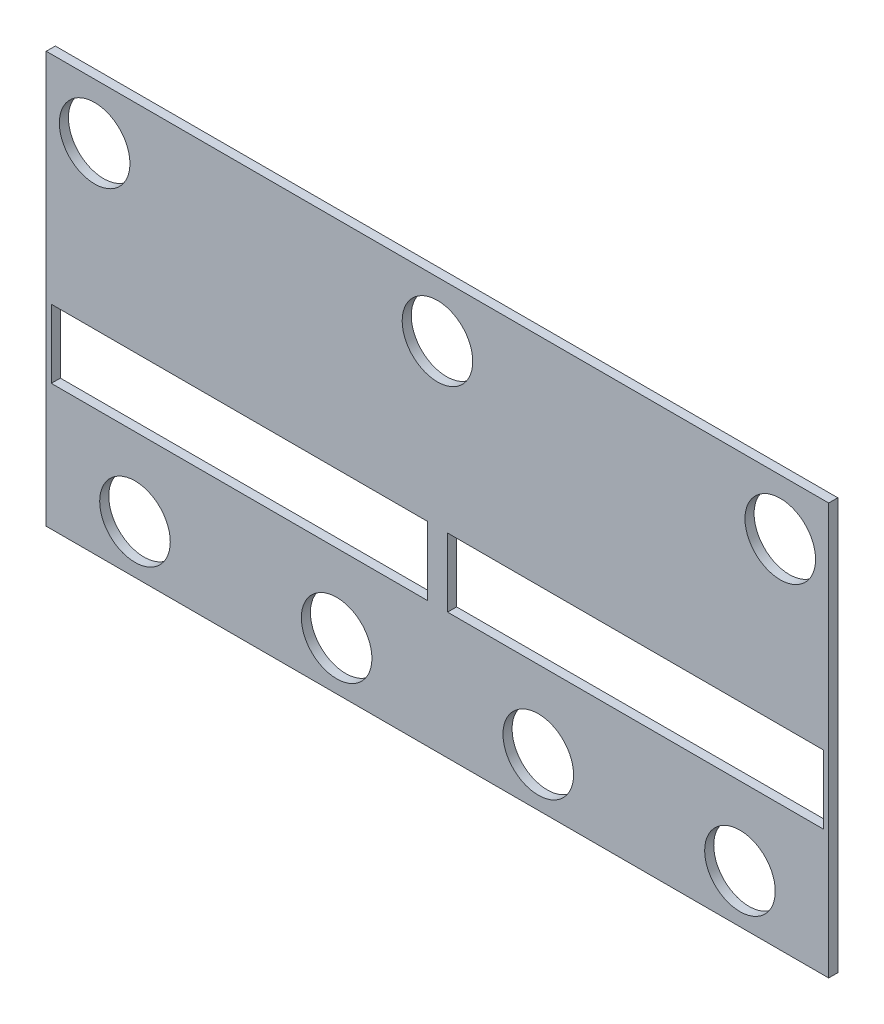
ISO-10303-21;
HEADER;
FILE_DESCRIPTION(('STEP AP214'),'2;1');
FILE_NAME('part.step','',(''),(''),'','','');
FILE_SCHEMA(('AUTOMOTIVE_DESIGN { 1 0 10303 214 1 1 1 1 }'));
ENDSEC;
DATA;
#1=APPLICATION_CONTEXT('core data for automotive mechanical design processes');
#2=APPLICATION_PROTOCOL_DEFINITION('international standard','automotive_design',2000,#1);
#3=PRODUCT_CONTEXT('',#1,'mechanical');
#4=PRODUCT('Part','Part','',(#3));
#5=PRODUCT_RELATED_PRODUCT_CATEGORY('part','',(#4));
#6=PRODUCT_DEFINITION_FORMATION('','',#4);
#7=PRODUCT_DEFINITION_CONTEXT('part definition',#1,'design');
#8=PRODUCT_DEFINITION('design','',#6,#7);
#9=PRODUCT_DEFINITION_SHAPE('','',#8);
#10=(LENGTH_UNIT() NAMED_UNIT(*) SI_UNIT(.MILLI.,.METRE.));
#11=(NAMED_UNIT(*) PLANE_ANGLE_UNIT() SI_UNIT($,.RADIAN.));
#12=(NAMED_UNIT(*) SI_UNIT($,.STERADIAN.) SOLID_ANGLE_UNIT());
#13=UNCERTAINTY_MEASURE_WITH_UNIT(LENGTH_MEASURE(1.E-05),#10,'distance_accuracy_value','');
#14=(GEOMETRIC_REPRESENTATION_CONTEXT(3) GLOBAL_UNCERTAINTY_ASSIGNED_CONTEXT((#13)) GLOBAL_UNIT_ASSIGNED_CONTEXT((#10,
#11,#12)) REPRESENTATION_CONTEXT('',''));
#15=CARTESIAN_POINT('',(0.,0.,0.));
#16=DIRECTION('',(0.,0.,1.));
#17=DIRECTION('',(1.,0.,0.));
#18=AXIS2_PLACEMENT_3D('',#15,#16,#17);
#19=CARTESIAN_POINT('',(-40.,25.,-3.));
#20=DIRECTION('',(0.,1.,0.));
#21=DIRECTION('',(0.,0.,1.));
#22=AXIS2_PLACEMENT_3D('',#19,#20,#21);
#23=PLANE('',#22);
#24=DIRECTION('',(0.,0.,1.));
#25=VECTOR('',#24,1.);
#26=CARTESIAN_POINT('',(-38.8,25.,-3.));
#27=LINE('',#26,#25);
#28=CARTESIAN_POINT('',(-38.8,25.,-3.));
#29=VERTEX_POINT('',#28);
#30=CARTESIAN_POINT('',(-38.8,25.,-2.1));
#31=VERTEX_POINT('',#30);
#32=EDGE_CURVE('E204',#29,#31,#27,.T.);
#33=ORIENTED_EDGE('',*,*,#32,.T.);
#34=DIRECTION('',(1.,0.,0.));
#35=VECTOR('',#34,1.);
#36=CARTESIAN_POINT('',(-38.8,25.,-2.1));
#37=LINE('',#36,#35);
#38=CARTESIAN_POINT('',(38.8,25.,-2.1));
#39=VERTEX_POINT('',#38);
#40=EDGE_CURVE('E58',#31,#39,#37,.T.);
#41=ORIENTED_EDGE('',*,*,#40,.T.);
#42=DIRECTION('',(0.,0.,1.));
#43=VECTOR('',#42,1.);
#44=CARTESIAN_POINT('',(38.8,25.,-3.));
#45=LINE('',#44,#43);
#46=CARTESIAN_POINT('',(38.8,25.,-3.));
#47=VERTEX_POINT('',#46);
#48=EDGE_CURVE('E145',#47,#39,#45,.T.);
#49=ORIENTED_EDGE('',*,*,#48,.F.);
#50=DIRECTION('',(-1.,0.,0.));
#51=VECTOR('',#50,1.);
#52=CARTESIAN_POINT('',(-40.,25.,-3.));
#53=LINE('',#52,#51);
#54=EDGE_CURVE('E13',#47,#29,#53,.T.);
#55=ORIENTED_EDGE('',*,*,#54,.T.);
#56=EDGE_LOOP('',(#33,#41,#49,#55));
#57=FACE_BOUND('',#56,.T.);
#58=ADVANCED_FACE('F43',(#57),#23,.T.);
#59=CARTESIAN_POINT('',(38.8,-15.8,1.));
#60=DIRECTION('',(-1.,0.,0.));
#61=DIRECTION('',(0.,0.,1.));
#62=AXIS2_PLACEMENT_3D('',#59,#60,#61);
#63=PLANE('',#62);
#64=DIRECTION('',(0.,-1.,0.));
#65=VECTOR('',#64,1.);
#66=CARTESIAN_POINT('',(38.8,25.,-2.1));
#67=LINE('',#66,#65);
#68=CARTESIAN_POINT('',(38.8,-15.8,-2.10000000000003));
#69=VERTEX_POINT('',#68);
#70=EDGE_CURVE('E134',#39,#69,#67,.T.);
#71=ORIENTED_EDGE('',*,*,#70,.T.);
#72=DIRECTION('',(0.,0.,-1.));
#73=VECTOR('',#72,1.);
#74=CARTESIAN_POINT('',(38.8,-15.8,1.));
#75=LINE('',#74,#73);
#76=CARTESIAN_POINT('',(38.8,-15.8,-3.));
#77=VERTEX_POINT('',#76);
#78=EDGE_CURVE('E51',#69,#77,#75,.T.);
#79=ORIENTED_EDGE('',*,*,#78,.T.);
#80=DIRECTION('',(0.,1.,0.));
#81=VECTOR('',#80,1.);
#82=CARTESIAN_POINT('',(38.8,16.,-3.));
#83=LINE('',#82,#81);
#84=EDGE_CURVE('E176',#77,#47,#83,.T.);
#85=ORIENTED_EDGE('',*,*,#84,.T.);
#86=ORIENTED_EDGE('',*,*,#48,.T.);
#87=EDGE_LOOP('',(#71,#79,#85,#86));
#88=FACE_BOUND('',#87,.T.);
#89=ADVANCED_FACE('F142',(#88),#63,.F.);
#90=CARTESIAN_POINT('',(-38.8,-15.8,1.));
#91=DIRECTION('',(0.,1.,0.));
#92=DIRECTION('',(-1.,0.,0.));
#93=AXIS2_PLACEMENT_3D('',#90,#91,#92);
#94=PLANE('',#93);
#95=DIRECTION('',(-1.,0.,0.));
#96=VECTOR('',#95,1.);
#97=CARTESIAN_POINT('',(-38.8,-15.8,-2.1));
#98=LINE('',#97,#96);
#99=CARTESIAN_POINT('',(-38.8,-15.8,-2.1));
#100=VERTEX_POINT('',#99);
#101=EDGE_CURVE('E130',#69,#100,#98,.T.);
#102=ORIENTED_EDGE('',*,*,#101,.T.);
#103=DIRECTION('',(0.,0.,-1.));
#104=VECTOR('',#103,1.);
#105=CARTESIAN_POINT('',(-38.8,-15.8,1.));
#106=LINE('',#105,#104);
#107=CARTESIAN_POINT('',(-38.8,-15.8,-3.));
#108=VERTEX_POINT('',#107);
#109=EDGE_CURVE('E151',#100,#108,#106,.T.);
#110=ORIENTED_EDGE('',*,*,#109,.T.);
#111=DIRECTION('',(1.,0.,0.));
#112=VECTOR('',#111,1.);
#113=CARTESIAN_POINT('',(38.8,-15.8,-3.));
#114=LINE('',#113,#112);
#115=EDGE_CURVE('E149',#108,#77,#114,.T.);
#116=ORIENTED_EDGE('',*,*,#115,.T.);
#117=ORIENTED_EDGE('',*,*,#78,.F.);
#118=EDGE_LOOP('',(#102,#110,#116,#117));
#119=FACE_BOUND('',#118,.T.);
#120=ADVANCED_FACE('F147',(#119),#94,.F.);
#121=CARTESIAN_POINT('',(-38.8,16.,1.));
#122=DIRECTION('',(1.,0.,0.));
#123=DIRECTION('',(0.,1.,0.));
#124=AXIS2_PLACEMENT_3D('',#121,#122,#123);
#125=PLANE('',#124);
#126=DIRECTION('',(0.,1.,0.));
#127=VECTOR('',#126,1.);
#128=CARTESIAN_POINT('',(-38.8,25.,-2.1));
#129=LINE('',#128,#127);
#130=EDGE_CURVE('E135',#100,#31,#129,.T.);
#131=ORIENTED_EDGE('',*,*,#130,.T.);
#132=ORIENTED_EDGE('',*,*,#32,.F.);
#133=DIRECTION('',(0.,-1.,0.));
#134=VECTOR('',#133,1.);
#135=CARTESIAN_POINT('',(-38.8,16.,-3.));
#136=LINE('',#135,#134);
#137=EDGE_CURVE('E179',#29,#108,#136,.T.);
#138=ORIENTED_EDGE('',*,*,#137,.T.);
#139=ORIENTED_EDGE('',*,*,#109,.F.);
#140=EDGE_LOOP('',(#131,#132,#138,#139));
#141=FACE_BOUND('',#140,.T.);
#142=ADVANCED_FACE('F264',(#141),#125,.F.);
#143=CARTESIAN_POINT('',(38.3,3.525,-1.55));
#144=DIRECTION('',(1.,0.,0.));
#145=DIRECTION('',(0.,0.,-1.));
#146=AXIS2_PLACEMENT_3D('',#143,#144,#145);
#147=PLANE('',#146);
#148=DIRECTION('',(0.,-1.,0.));
#149=VECTOR('',#148,1.);
#150=CARTESIAN_POINT('',(38.3,3.525,-2.1));
#151=LINE('',#150,#149);
#152=CARTESIAN_POINT('',(38.3,3.525,-2.1));
#153=VERTEX_POINT('',#152);
#154=CARTESIAN_POINT('',(38.3,-3.275,-2.1));
#155=VERTEX_POINT('',#154);
#156=EDGE_CURVE('E66',#153,#155,#151,.T.);
#157=ORIENTED_EDGE('',*,*,#156,.F.);
#158=DIRECTION('',(0.,0.,-1.));
#159=VECTOR('',#158,1.);
#160=CARTESIAN_POINT('',(38.3,3.525,-1.55));
#161=LINE('',#160,#159);
#162=CARTESIAN_POINT('',(38.3,3.525,-3.));
#163=VERTEX_POINT('',#162);
#164=EDGE_CURVE('E182',#153,#163,#161,.T.);
#165=ORIENTED_EDGE('',*,*,#164,.T.);
#166=DIRECTION('',(0.,-1.,0.));
#167=VECTOR('',#166,1.);
#168=CARTESIAN_POINT('',(38.3,3.525,-3.));
#169=LINE('',#168,#167);
#170=CARTESIAN_POINT('',(38.3,-3.275,-3.));
#171=VERTEX_POINT('',#170);
#172=EDGE_CURVE('E192',#163,#171,#169,.T.);
#173=ORIENTED_EDGE('',*,*,#172,.T.);
#174=DIRECTION('',(0.,0.,-1.));
#175=VECTOR('',#174,1.);
#176=CARTESIAN_POINT('',(38.3,-3.275,-1.55));
#177=LINE('',#176,#175);
#178=EDGE_CURVE('E205',#155,#171,#177,.T.);
#179=ORIENTED_EDGE('',*,*,#178,.F.);
#180=EDGE_LOOP('',(#157,#165,#173,#179));
#181=FACE_BOUND('',#180,.T.);
#182=ADVANCED_FACE('F295',(#181),#147,.F.);
#183=CARTESIAN_POINT('',(38.3,3.525,-1.55));
#184=DIRECTION('',(0.,1.,0.));
#185=DIRECTION('',(-1.,0.,0.));
#186=AXIS2_PLACEMENT_3D('',#183,#184,#185);
#187=PLANE('',#186);
#188=DIRECTION('',(1.,0.,0.));
#189=VECTOR('',#188,1.);
#190=CARTESIAN_POINT('',(38.3,3.525,-2.1));
#191=LINE('',#190,#189);
#192=CARTESIAN_POINT('',(1.00000000000002,3.52500000000002,-2.1));
#193=VERTEX_POINT('',#192);
#194=EDGE_CURVE('E227',#193,#153,#191,.T.);
#195=ORIENTED_EDGE('',*,*,#194,.F.);
#196=DIRECTION('',(0.,0.,-1.));
#197=VECTOR('',#196,1.);
#198=CARTESIAN_POINT('',(1.00000000000002,3.52500000000002,-1.55));
#199=LINE('',#198,#197);
#200=CARTESIAN_POINT('',(1.00000000000002,3.52500000000002,-3.));
#201=VERTEX_POINT('',#200);
#202=EDGE_CURVE('E210',#193,#201,#199,.T.);
#203=ORIENTED_EDGE('',*,*,#202,.T.);
#204=DIRECTION('',(1.,0.,0.));
#205=VECTOR('',#204,1.);
#206=CARTESIAN_POINT('',(38.3,3.525,-3.));
#207=LINE('',#206,#205);
#208=EDGE_CURVE('E208',#201,#163,#207,.T.);
#209=ORIENTED_EDGE('',*,*,#208,.T.);
#210=ORIENTED_EDGE('',*,*,#164,.F.);
#211=EDGE_LOOP('',(#195,#203,#209,#210));
#212=FACE_BOUND('',#211,.T.);
#213=ADVANCED_FACE('F299',(#212),#187,.F.);
#214=CARTESIAN_POINT('',(1.00000000000002,3.52500000000002,-1.55));
#215=DIRECTION('',(-1.,0.,0.));
#216=DIRECTION('',(0.,-1.,0.));
#217=AXIS2_PLACEMENT_3D('',#214,#215,#216);
#218=PLANE('',#217);
#219=DIRECTION('',(0.,1.,0.));
#220=VECTOR('',#219,1.);
#221=CARTESIAN_POINT('',(1.00000000000002,3.52500000000002,-2.1));
#222=LINE('',#221,#220);
#223=CARTESIAN_POINT('',(1.00000000000002,-3.275,-2.1));
#224=VERTEX_POINT('',#223);
#225=EDGE_CURVE('E229',#224,#193,#222,.T.);
#226=ORIENTED_EDGE('',*,*,#225,.F.);
#227=DIRECTION('',(0.,0.,-1.));
#228=VECTOR('',#227,1.);
#229=CARTESIAN_POINT('',(1.00000000000002,-3.275,-1.55));
#230=LINE('',#229,#228);
#231=CARTESIAN_POINT('',(1.00000000000002,-3.275,-3.));
#232=VERTEX_POINT('',#231);
#233=EDGE_CURVE('E207',#224,#232,#230,.T.);
#234=ORIENTED_EDGE('',*,*,#233,.T.);
#235=DIRECTION('',(0.,1.,0.));
#236=VECTOR('',#235,1.);
#237=CARTESIAN_POINT('',(1.00000000000002,3.52500000000002,-3.));
#238=LINE('',#237,#236);
#239=EDGE_CURVE('E215',#232,#201,#238,.T.);
#240=ORIENTED_EDGE('',*,*,#239,.T.);
#241=ORIENTED_EDGE('',*,*,#202,.F.);
#242=EDGE_LOOP('',(#226,#234,#240,#241));
#243=FACE_BOUND('',#242,.T.);
#244=ADVANCED_FACE('F305',(#243),#218,.F.);
#245=CARTESIAN_POINT('',(38.3,-3.275,-1.55));
#246=DIRECTION('',(0.,-1.,0.));
#247=DIRECTION('',(0.,0.,-1.));
#248=AXIS2_PLACEMENT_3D('',#245,#246,#247);
#249=PLANE('',#248);
#250=DIRECTION('',(-1.,0.,0.));
#251=VECTOR('',#250,1.);
#252=CARTESIAN_POINT('',(38.3,-3.275,-2.1));
#253=LINE('',#252,#251);
#254=EDGE_CURVE('E231',#155,#224,#253,.T.);
#255=ORIENTED_EDGE('',*,*,#254,.F.);
#256=ORIENTED_EDGE('',*,*,#178,.T.);
#257=DIRECTION('',(-1.,0.,0.));
#258=VECTOR('',#257,1.);
#259=CARTESIAN_POINT('',(38.3,-3.275,-3.));
#260=LINE('',#259,#258);
#261=EDGE_CURVE('E218',#171,#232,#260,.T.);
#262=ORIENTED_EDGE('',*,*,#261,.T.);
#263=ORIENTED_EDGE('',*,*,#233,.F.);
#264=EDGE_LOOP('',(#255,#256,#262,#263));
#265=FACE_BOUND('',#264,.T.);
#266=ADVANCED_FACE('F310',(#265),#249,.F.);
#267=CARTESIAN_POINT('',(-38.3,3.525,-1.55));
#268=DIRECTION('',(-1.,0.,0.));
#269=DIRECTION('',(0.,0.,1.));
#270=AXIS2_PLACEMENT_3D('',#267,#268,#269);
#271=PLANE('',#270);
#272=DIRECTION('',(0.,1.,0.));
#273=VECTOR('',#272,1.);
#274=CARTESIAN_POINT('',(-38.3,3.525,-2.1));
#275=LINE('',#274,#273);
#276=CARTESIAN_POINT('',(-38.3,-3.27499999999995,-2.1));
#277=VERTEX_POINT('',#276);
#278=CARTESIAN_POINT('',(-38.3,3.525,-2.1));
#279=VERTEX_POINT('',#278);
#280=EDGE_CURVE('E233',#277,#279,#275,.T.);
#281=ORIENTED_EDGE('',*,*,#280,.F.);
#282=DIRECTION('',(0.,0.,-1.));
#283=VECTOR('',#282,1.);
#284=CARTESIAN_POINT('',(-38.3,-3.27499999999995,-1.55));
#285=LINE('',#284,#283);
#286=CARTESIAN_POINT('',(-38.3,-3.27499999999995,-3.));
#287=VERTEX_POINT('',#286);
#288=EDGE_CURVE('E190',#277,#287,#285,.T.);
#289=ORIENTED_EDGE('',*,*,#288,.T.);
#290=DIRECTION('',(0.,1.,0.));
#291=VECTOR('',#290,1.);
#292=CARTESIAN_POINT('',(-38.3,3.525,-3.));
#293=LINE('',#292,#291);
#294=CARTESIAN_POINT('',(-38.3,3.525,-3.));
#295=VERTEX_POINT('',#294);
#296=EDGE_CURVE('E201',#287,#295,#293,.T.);
#297=ORIENTED_EDGE('',*,*,#296,.T.);
#298=DIRECTION('',(0.,0.,-1.));
#299=VECTOR('',#298,1.);
#300=CARTESIAN_POINT('',(-38.3,3.525,-1.55));
#301=LINE('',#300,#299);
#302=EDGE_CURVE('E183',#279,#295,#301,.T.);
#303=ORIENTED_EDGE('',*,*,#302,.F.);
#304=EDGE_LOOP('',(#281,#289,#297,#303));
#305=FACE_BOUND('',#304,.T.);
#306=ADVANCED_FACE('F316',(#305),#271,.F.);
#307=CARTESIAN_POINT('',(-38.3,-3.27499999999995,-1.55));
#308=DIRECTION('',(0.,-1.,0.));
#309=DIRECTION('',(1.,0.,0.));
#310=AXIS2_PLACEMENT_3D('',#307,#308,#309);
#311=PLANE('',#310);
#312=DIRECTION('',(-1.,0.,0.));
#313=VECTOR('',#312,1.);
#314=CARTESIAN_POINT('',(-38.3,-3.27499999999995,-2.1));
#315=LINE('',#314,#313);
#316=CARTESIAN_POINT('',(-1.00000000000003,-3.275,-2.1));
#317=VERTEX_POINT('',#316);
#318=EDGE_CURVE('E235',#317,#277,#315,.T.);
#319=ORIENTED_EDGE('',*,*,#318,.F.);
#320=DIRECTION('',(0.,0.,-1.));
#321=VECTOR('',#320,1.);
#322=CARTESIAN_POINT('',(-1.00000000000003,-3.275,-1.55));
#323=LINE('',#322,#321);
#324=CARTESIAN_POINT('',(-1.00000000000003,-3.275,-3.));
#325=VERTEX_POINT('',#324);
#326=EDGE_CURVE('E188',#317,#325,#323,.T.);
#327=ORIENTED_EDGE('',*,*,#326,.T.);
#328=DIRECTION('',(-1.,0.,0.));
#329=VECTOR('',#328,1.);
#330=CARTESIAN_POINT('',(-38.3,-3.27499999999995,-3.));
#331=LINE('',#330,#329);
#332=EDGE_CURVE('E186',#325,#287,#331,.T.);
#333=ORIENTED_EDGE('',*,*,#332,.T.);
#334=ORIENTED_EDGE('',*,*,#288,.F.);
#335=EDGE_LOOP('',(#319,#327,#333,#334));
#336=FACE_BOUND('',#335,.T.);
#337=ADVANCED_FACE('F312',(#336),#311,.F.);
#338=CARTESIAN_POINT('',(-1.00000000000002,3.52500000000002,-1.55));
#339=DIRECTION('',(1.,0.,0.));
#340=DIRECTION('',(0.,1.,0.));
#341=AXIS2_PLACEMENT_3D('',#338,#339,#340);
#342=PLANE('',#341);
#343=DIRECTION('',(0.,-1.,0.));
#344=VECTOR('',#343,1.);
#345=CARTESIAN_POINT('',(-1.00000000000002,3.52500000000002,-2.1));
#346=LINE('',#345,#344);
#347=CARTESIAN_POINT('',(-1.00000000000003,3.52500000000002,-2.1));
#348=VERTEX_POINT('',#347);
#349=EDGE_CURVE('E237',#348,#317,#346,.T.);
#350=ORIENTED_EDGE('',*,*,#349,.F.);
#351=DIRECTION('',(0.,0.,-1.));
#352=VECTOR('',#351,1.);
#353=CARTESIAN_POINT('',(-1.00000000000002,3.52500000000002,-1.55));
#354=LINE('',#353,#352);
#355=CARTESIAN_POINT('',(-1.00000000000002,3.52500000000002,-3.));
#356=VERTEX_POINT('',#355);
#357=EDGE_CURVE('E185',#348,#356,#354,.T.);
#358=ORIENTED_EDGE('',*,*,#357,.T.);
#359=DIRECTION('',(0.,-1.,0.));
#360=VECTOR('',#359,1.);
#361=CARTESIAN_POINT('',(-1.00000000000002,3.52500000000002,-3.));
#362=LINE('',#361,#360);
#363=EDGE_CURVE('E195',#356,#325,#362,.T.);
#364=ORIENTED_EDGE('',*,*,#363,.T.);
#365=ORIENTED_EDGE('',*,*,#326,.F.);
#366=EDGE_LOOP('',(#350,#358,#364,#365));
#367=FACE_BOUND('',#366,.T.);
#368=ADVANCED_FACE('F315',(#367),#342,.F.);
#369=CARTESIAN_POINT('',(-38.3,3.525,-1.55));
#370=DIRECTION('',(0.,1.,0.));
#371=DIRECTION('',(-1.,0.,0.));
#372=AXIS2_PLACEMENT_3D('',#369,#370,#371);
#373=PLANE('',#372);
#374=DIRECTION('',(1.,0.,0.));
#375=VECTOR('',#374,1.);
#376=CARTESIAN_POINT('',(-38.3,3.525,-2.1));
#377=LINE('',#376,#375);
#378=EDGE_CURVE('E239',#279,#348,#377,.T.);
#379=ORIENTED_EDGE('',*,*,#378,.F.);
#380=ORIENTED_EDGE('',*,*,#302,.T.);
#381=DIRECTION('',(1.,0.,0.));
#382=VECTOR('',#381,1.);
#383=CARTESIAN_POINT('',(-38.3,3.525,-3.));
#384=LINE('',#383,#382);
#385=EDGE_CURVE('E198',#295,#356,#384,.T.);
#386=ORIENTED_EDGE('',*,*,#385,.T.);
#387=ORIENTED_EDGE('',*,*,#357,.F.);
#388=EDGE_LOOP('',(#379,#380,#386,#387));
#389=FACE_BOUND('',#388,.T.);
#390=ADVANCED_FACE('F320',(#389),#373,.F.);
#391=CARTESIAN_POINT('',(-34.,19.5,-3.));
#392=DIRECTION('',(0.,0.,-1.));
#393=DIRECTION('',(-1.,0.,0.));
#394=AXIS2_PLACEMENT_3D('',#391,#392,#393);
#395=CYLINDRICAL_SURFACE('',#394,3.50000000000001);
#396=CARTESIAN_POINT('',(-34.,19.5,-3.));
#397=DIRECTION('',(0.,0.,-1.));
#398=DIRECTION('',(-1.,0.,0.));
#399=AXIS2_PLACEMENT_3D('',#396,#397,#398);
#400=CIRCLE('',#399,3.50000000000001);
#401=CARTESIAN_POINT('',(-37.5,19.5,-3.));
#402=VERTEX_POINT('',#401);
#403=EDGE_CURVE('E153',#402,#402,#400,.T.);
#404=ORIENTED_EDGE('',*,*,#403,.T.);
#405=EDGE_LOOP('',(#404));
#406=FACE_BOUND('',#405,.T.);
#407=CARTESIAN_POINT('',(-34.,19.5,-2.1));
#408=DIRECTION('',(0.,0.,1.));
#409=DIRECTION('',(1.,0.,0.));
#410=AXIS2_PLACEMENT_3D('',#407,#408,#409);
#411=CIRCLE('',#410,3.50000000000001);
#412=CARTESIAN_POINT('',(-30.5,19.5,-2.1));
#413=VERTEX_POINT('',#412);
#414=EDGE_CURVE('E241',#413,#413,#411,.F.);
#415=ORIENTED_EDGE('',*,*,#414,.F.);
#416=EDGE_LOOP('',(#415));
#417=FACE_BOUND('',#416,.T.);
#418=ADVANCED_FACE('F292',(#406,#417),#395,.F.);
#419=CARTESIAN_POINT('',(0.,19.5,-3.));
#420=DIRECTION('',(0.,0.,-1.));
#421=DIRECTION('',(-1.,0.,0.));
#422=AXIS2_PLACEMENT_3D('',#419,#420,#421);
#423=CYLINDRICAL_SURFACE('',#422,3.50000000000001);
#424=CARTESIAN_POINT('',(0.,19.5,-3.));
#425=DIRECTION('',(0.,0.,-1.));
#426=DIRECTION('',(-1.,0.,0.));
#427=AXIS2_PLACEMENT_3D('',#424,#425,#426);
#428=CIRCLE('',#427,3.50000000000001);
#429=CARTESIAN_POINT('',(-3.50000000000001,19.5,-3.));
#430=VERTEX_POINT('',#429);
#431=EDGE_CURVE('E158',#430,#430,#428,.T.);
#432=ORIENTED_EDGE('',*,*,#431,.T.);
#433=EDGE_LOOP('',(#432));
#434=FACE_BOUND('',#433,.T.);
#435=CARTESIAN_POINT('',(0.,19.5,-2.1));
#436=DIRECTION('',(0.,0.,1.));
#437=DIRECTION('',(1.,0.,0.));
#438=AXIS2_PLACEMENT_3D('',#435,#436,#437);
#439=CIRCLE('',#438,3.50000000000001);
#440=CARTESIAN_POINT('',(3.50000000000001,19.5,-2.1));
#441=VERTEX_POINT('',#440);
#442=EDGE_CURVE('E244',#441,#441,#439,.F.);
#443=ORIENTED_EDGE('',*,*,#442,.F.);
#444=EDGE_LOOP('',(#443));
#445=FACE_BOUND('',#444,.T.);
#446=ADVANCED_FACE('F341',(#434,#445),#423,.F.);
#447=CARTESIAN_POINT('',(34.,19.5,-3.));
#448=DIRECTION('',(0.,0.,-1.));
#449=DIRECTION('',(-1.,0.,0.));
#450=AXIS2_PLACEMENT_3D('',#447,#448,#449);
#451=CYLINDRICAL_SURFACE('',#450,3.50000000000002);
#452=CARTESIAN_POINT('',(34.,19.5,-3.));
#453=DIRECTION('',(0.,0.,-1.));
#454=DIRECTION('',(-1.,0.,0.));
#455=AXIS2_PLACEMENT_3D('',#452,#453,#454);
#456=CIRCLE('',#455,3.50000000000002);
#457=CARTESIAN_POINT('',(30.5,19.5,-3.));
#458=VERTEX_POINT('',#457);
#459=EDGE_CURVE('E161',#458,#458,#456,.T.);
#460=ORIENTED_EDGE('',*,*,#459,.T.);
#461=EDGE_LOOP('',(#460));
#462=FACE_BOUND('',#461,.T.);
#463=CARTESIAN_POINT('',(34.,19.5,-2.1));
#464=DIRECTION('',(0.,0.,1.));
#465=DIRECTION('',(1.,0.,0.));
#466=AXIS2_PLACEMENT_3D('',#463,#464,#465);
#467=CIRCLE('',#466,3.50000000000002);
#468=CARTESIAN_POINT('',(37.5,19.5,-2.1));
#469=VERTEX_POINT('',#468);
#470=EDGE_CURVE('E247',#469,#469,#467,.F.);
#471=ORIENTED_EDGE('',*,*,#470,.F.);
#472=EDGE_LOOP('',(#471));
#473=FACE_BOUND('',#472,.T.);
#474=ADVANCED_FACE('F338',(#462,#473),#451,.F.);
#475=CARTESIAN_POINT('',(-30.,-11.,-3.));
#476=DIRECTION('',(0.,0.,-1.));
#477=DIRECTION('',(-1.,0.,0.));
#478=AXIS2_PLACEMENT_3D('',#475,#476,#477);
#479=CYLINDRICAL_SURFACE('',#478,3.50000000000001);
#480=CARTESIAN_POINT('',(-30.,-11.,-3.));
#481=DIRECTION('',(0.,0.,-1.));
#482=DIRECTION('',(-1.,0.,0.));
#483=AXIS2_PLACEMENT_3D('',#480,#481,#482);
#484=CIRCLE('',#483,3.50000000000001);
#485=CARTESIAN_POINT('',(-33.5,-11.,-3.));
#486=VERTEX_POINT('',#485);
#487=EDGE_CURVE('E164',#486,#486,#484,.T.);
#488=ORIENTED_EDGE('',*,*,#487,.T.);
#489=EDGE_LOOP('',(#488));
#490=FACE_BOUND('',#489,.T.);
#491=CARTESIAN_POINT('',(-30.,-11.,-2.1));
#492=DIRECTION('',(0.,0.,1.));
#493=DIRECTION('',(1.,0.,0.));
#494=AXIS2_PLACEMENT_3D('',#491,#492,#493);
#495=CIRCLE('',#494,3.50000000000001);
#496=CARTESIAN_POINT('',(-26.5,-11.,-2.1));
#497=VERTEX_POINT('',#496);
#498=EDGE_CURVE('E250',#497,#497,#495,.F.);
#499=ORIENTED_EDGE('',*,*,#498,.F.);
#500=EDGE_LOOP('',(#499));
#501=FACE_BOUND('',#500,.T.);
#502=ADVANCED_FACE('F334',(#490,#501),#479,.F.);
#503=CARTESIAN_POINT('',(-10.,-11.,-3.));
#504=DIRECTION('',(0.,0.,-1.));
#505=DIRECTION('',(-1.,0.,0.));
#506=AXIS2_PLACEMENT_3D('',#503,#504,#505);
#507=CYLINDRICAL_SURFACE('',#506,3.50000000000001);
#508=CARTESIAN_POINT('',(-10.,-11.,-3.));
#509=DIRECTION('',(0.,0.,-1.));
#510=DIRECTION('',(-1.,0.,0.));
#511=AXIS2_PLACEMENT_3D('',#508,#509,#510);
#512=CIRCLE('',#511,3.50000000000001);
#513=CARTESIAN_POINT('',(-13.5,-11.,-3.));
#514=VERTEX_POINT('',#513);
#515=EDGE_CURVE('E167',#514,#514,#512,.T.);
#516=ORIENTED_EDGE('',*,*,#515,.T.);
#517=EDGE_LOOP('',(#516));
#518=FACE_BOUND('',#517,.T.);
#519=CARTESIAN_POINT('',(-10.,-11.,-2.1));
#520=DIRECTION('',(0.,0.,1.));
#521=DIRECTION('',(1.,0.,0.));
#522=AXIS2_PLACEMENT_3D('',#519,#520,#521);
#523=CIRCLE('',#522,3.50000000000001);
#524=CARTESIAN_POINT('',(-6.49999999999998,-11.,-2.1));
#525=VERTEX_POINT('',#524);
#526=EDGE_CURVE('E253',#525,#525,#523,.F.);
#527=ORIENTED_EDGE('',*,*,#526,.F.);
#528=EDGE_LOOP('',(#527));
#529=FACE_BOUND('',#528,.T.);
#530=ADVANCED_FACE('F330',(#518,#529),#507,.F.);
#531=CARTESIAN_POINT('',(10.,-11.,-3.));
#532=DIRECTION('',(0.,0.,-1.));
#533=DIRECTION('',(-1.,0.,0.));
#534=AXIS2_PLACEMENT_3D('',#531,#532,#533);
#535=CYLINDRICAL_SURFACE('',#534,3.50000000000001);
#536=CARTESIAN_POINT('',(10.,-11.,-3.));
#537=DIRECTION('',(0.,0.,-1.));
#538=DIRECTION('',(-1.,0.,0.));
#539=AXIS2_PLACEMENT_3D('',#536,#537,#538);
#540=CIRCLE('',#539,3.50000000000001);
#541=CARTESIAN_POINT('',(6.49999999999998,-11.,-3.));
#542=VERTEX_POINT('',#541);
#543=EDGE_CURVE('E170',#542,#542,#540,.T.);
#544=ORIENTED_EDGE('',*,*,#543,.T.);
#545=EDGE_LOOP('',(#544));
#546=FACE_BOUND('',#545,.T.);
#547=CARTESIAN_POINT('',(10.,-11.,-2.1));
#548=DIRECTION('',(0.,0.,1.));
#549=DIRECTION('',(1.,0.,0.));
#550=AXIS2_PLACEMENT_3D('',#547,#548,#549);
#551=CIRCLE('',#550,3.50000000000001);
#552=CARTESIAN_POINT('',(13.5,-11.,-2.1));
#553=VERTEX_POINT('',#552);
#554=EDGE_CURVE('E256',#553,#553,#551,.F.);
#555=ORIENTED_EDGE('',*,*,#554,.F.);
#556=EDGE_LOOP('',(#555));
#557=FACE_BOUND('',#556,.T.);
#558=ADVANCED_FACE('F276',(#546,#557),#535,.F.);
#559=CARTESIAN_POINT('',(30.,-11.,-3.));
#560=DIRECTION('',(0.,0.,-1.));
#561=DIRECTION('',(-1.,0.,0.));
#562=AXIS2_PLACEMENT_3D('',#559,#560,#561);
#563=CYLINDRICAL_SURFACE('',#562,3.50000000000002);
#564=CARTESIAN_POINT('',(30.,-11.,-3.));
#565=DIRECTION('',(0.,0.,-1.));
#566=DIRECTION('',(-1.,0.,0.));
#567=AXIS2_PLACEMENT_3D('',#564,#565,#566);
#568=CIRCLE('',#567,3.50000000000002);
#569=CARTESIAN_POINT('',(26.5,-11.,-3.));
#570=VERTEX_POINT('',#569);
#571=EDGE_CURVE('E173',#570,#570,#568,.T.);
#572=ORIENTED_EDGE('',*,*,#571,.T.);
#573=EDGE_LOOP('',(#572));
#574=FACE_BOUND('',#573,.T.);
#575=CARTESIAN_POINT('',(30.,-11.,-2.1));
#576=DIRECTION('',(0.,0.,1.));
#577=DIRECTION('',(1.,0.,0.));
#578=AXIS2_PLACEMENT_3D('',#575,#576,#577);
#579=CIRCLE('',#578,3.50000000000002);
#580=CARTESIAN_POINT('',(33.5,-11.,-2.1));
#581=VERTEX_POINT('',#580);
#582=EDGE_CURVE('E46',#581,#581,#579,.F.);
#583=ORIENTED_EDGE('',*,*,#582,.F.);
#584=EDGE_LOOP('',(#583));
#585=FACE_BOUND('',#584,.T.);
#586=ADVANCED_FACE('F268',(#574,#585),#563,.F.);
#587=CARTESIAN_POINT('',(0.,0.,-3.));
#588=DIRECTION('',(0.,0.,1.));
#589=DIRECTION('',(1.,0.,0.));
#590=AXIS2_PLACEMENT_3D('',#587,#588,#589);
#591=PLANE('',#590);
#592=ORIENTED_EDGE('',*,*,#261,.F.);
#593=ORIENTED_EDGE('',*,*,#172,.F.);
#594=ORIENTED_EDGE('',*,*,#208,.F.);
#595=ORIENTED_EDGE('',*,*,#239,.F.);
#596=EDGE_LOOP('',(#592,#593,#594,#595));
#597=FACE_BOUND('',#596,.T.);
#598=ORIENTED_EDGE('',*,*,#385,.F.);
#599=ORIENTED_EDGE('',*,*,#296,.F.);
#600=ORIENTED_EDGE('',*,*,#332,.F.);
#601=ORIENTED_EDGE('',*,*,#363,.F.);
#602=EDGE_LOOP('',(#598,#599,#600,#601));
#603=FACE_BOUND('',#602,.T.);
#604=ORIENTED_EDGE('',*,*,#571,.F.);
#605=EDGE_LOOP('',(#604));
#606=FACE_BOUND('',#605,.T.);
#607=ORIENTED_EDGE('',*,*,#543,.F.);
#608=EDGE_LOOP('',(#607));
#609=FACE_BOUND('',#608,.T.);
#610=ORIENTED_EDGE('',*,*,#515,.F.);
#611=EDGE_LOOP('',(#610));
#612=FACE_BOUND('',#611,.T.);
#613=ORIENTED_EDGE('',*,*,#487,.F.);
#614=EDGE_LOOP('',(#613));
#615=FACE_BOUND('',#614,.T.);
#616=ORIENTED_EDGE('',*,*,#459,.F.);
#617=EDGE_LOOP('',(#616));
#618=FACE_BOUND('',#617,.T.);
#619=ORIENTED_EDGE('',*,*,#431,.F.);
#620=EDGE_LOOP('',(#619));
#621=FACE_BOUND('',#620,.T.);
#622=ORIENTED_EDGE('',*,*,#403,.F.);
#623=EDGE_LOOP('',(#622));
#624=FACE_BOUND('',#623,.T.);
#625=ORIENTED_EDGE('',*,*,#137,.F.);
#626=ORIENTED_EDGE('',*,*,#54,.F.);
#627=ORIENTED_EDGE('',*,*,#84,.F.);
#628=ORIENTED_EDGE('',*,*,#115,.F.);
#629=EDGE_LOOP('',(#625,#626,#627,#628));
#630=FACE_BOUND('',#629,.T.);
#631=ADVANCED_FACE('F266',(#597,#603,#606,#609,#612,#615,#618,#621,#624,#630),#591,.F.);
#632=CARTESIAN_POINT('',(0.,0.,-2.1));
#633=DIRECTION('',(0.,0.,1.));
#634=DIRECTION('',(1.,0.,0.));
#635=AXIS2_PLACEMENT_3D('',#632,#633,#634);
#636=PLANE('',#635);
#637=ORIENTED_EDGE('',*,*,#280,.T.);
#638=ORIENTED_EDGE('',*,*,#378,.T.);
#639=ORIENTED_EDGE('',*,*,#349,.T.);
#640=ORIENTED_EDGE('',*,*,#318,.T.);
#641=EDGE_LOOP('',(#637,#638,#639,#640));
#642=FACE_BOUND('',#641,.T.);
#643=ORIENTED_EDGE('',*,*,#130,.F.);
#644=ORIENTED_EDGE('',*,*,#101,.F.);
#645=ORIENTED_EDGE('',*,*,#70,.F.);
#646=ORIENTED_EDGE('',*,*,#40,.F.);
#647=EDGE_LOOP('',(#643,#644,#645,#646));
#648=FACE_BOUND('',#647,.T.);
#649=ORIENTED_EDGE('',*,*,#582,.T.);
#650=EDGE_LOOP('',(#649));
#651=FACE_BOUND('',#650,.T.);
#652=ORIENTED_EDGE('',*,*,#554,.T.);
#653=EDGE_LOOP('',(#652));
#654=FACE_BOUND('',#653,.T.);
#655=ORIENTED_EDGE('',*,*,#526,.T.);
#656=EDGE_LOOP('',(#655));
#657=FACE_BOUND('',#656,.T.);
#658=ORIENTED_EDGE('',*,*,#498,.T.);
#659=EDGE_LOOP('',(#658));
#660=FACE_BOUND('',#659,.T.);
#661=ORIENTED_EDGE('',*,*,#470,.T.);
#662=EDGE_LOOP('',(#661));
#663=FACE_BOUND('',#662,.T.);
#664=ORIENTED_EDGE('',*,*,#442,.T.);
#665=EDGE_LOOP('',(#664));
#666=FACE_BOUND('',#665,.T.);
#667=ORIENTED_EDGE('',*,*,#414,.T.);
#668=EDGE_LOOP('',(#667));
#669=FACE_BOUND('',#668,.T.);
#670=ORIENTED_EDGE('',*,*,#156,.T.);
#671=ORIENTED_EDGE('',*,*,#254,.T.);
#672=ORIENTED_EDGE('',*,*,#225,.T.);
#673=ORIENTED_EDGE('',*,*,#194,.T.);
#674=EDGE_LOOP('',(#670,#671,#672,#673));
#675=FACE_BOUND('',#674,.T.);
#676=ADVANCED_FACE('F132',(#642,#648,#651,#654,#657,#660,#663,#666,#669,#675),#636,.T.);
#677=CLOSED_SHELL('',(#58,#89,#120,#142,#182,#213,#244,#266,#306,#337,#368,#390,#418,#446,#474,
#502,#530,#558,#586,#631,#676));
#678=MANIFOLD_SOLID_BREP('B2',#677);
#679=ADVANCED_BREP_SHAPE_REPRESENTATION('',(#18,#678),#14);
#680=SHAPE_DEFINITION_REPRESENTATION(#9,#679);
ENDSEC;
END-ISO-10303-21;
